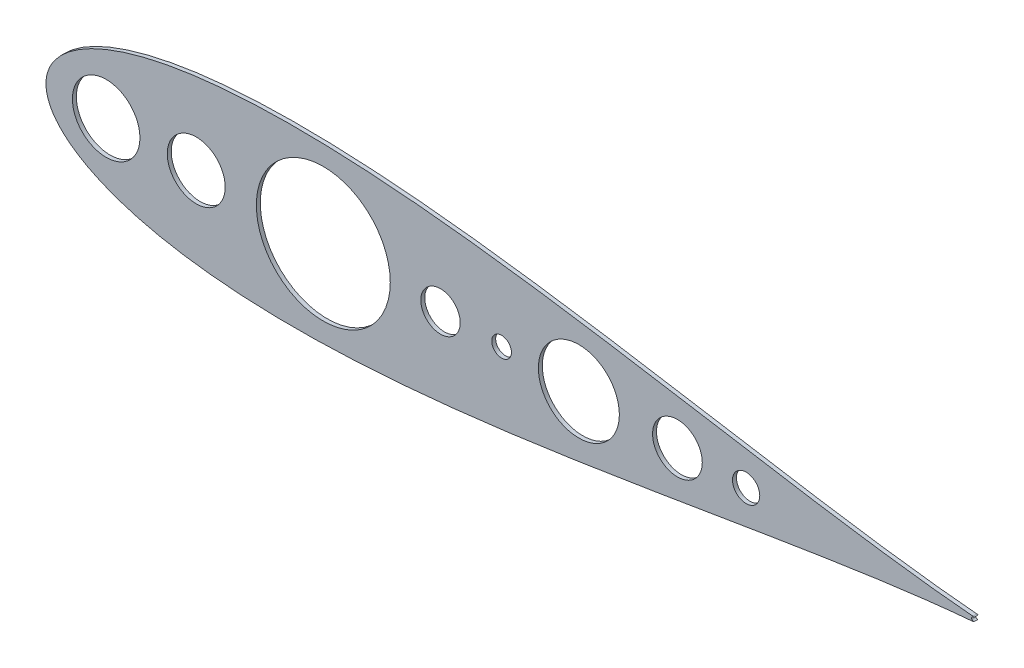
ISO-10303-21;
HEADER;
FILE_DESCRIPTION(('STEP AP214'),'2;1');
FILE_NAME('part.step','',(''),(''),'','','');
FILE_SCHEMA(('AUTOMOTIVE_DESIGN { 1 0 10303 214 1 1 1 1 }'));
ENDSEC;
DATA;
#1=APPLICATION_CONTEXT('core data for automotive mechanical design processes');
#2=APPLICATION_PROTOCOL_DEFINITION('international standard','automotive_design',2000,#1);
#3=PRODUCT_CONTEXT('',#1,'mechanical');
#4=PRODUCT('Part','Part','',(#3));
#5=PRODUCT_RELATED_PRODUCT_CATEGORY('part','',(#4));
#6=PRODUCT_DEFINITION_FORMATION('','',#4);
#7=PRODUCT_DEFINITION_CONTEXT('part definition',#1,'design');
#8=PRODUCT_DEFINITION('design','',#6,#7);
#9=PRODUCT_DEFINITION_SHAPE('','',#8);
#10=(LENGTH_UNIT() NAMED_UNIT(*) SI_UNIT(.MILLI.,.METRE.));
#11=(NAMED_UNIT(*) PLANE_ANGLE_UNIT() SI_UNIT($,.RADIAN.));
#12=(NAMED_UNIT(*) SI_UNIT($,.STERADIAN.) SOLID_ANGLE_UNIT());
#13=UNCERTAINTY_MEASURE_WITH_UNIT(LENGTH_MEASURE(1.E-05),#10,'distance_accuracy_value','');
#14=(GEOMETRIC_REPRESENTATION_CONTEXT(3) GLOBAL_UNCERTAINTY_ASSIGNED_CONTEXT((#13)) GLOBAL_UNIT_ASSIGNED_CONTEXT((#10,
#11,#12)) REPRESENTATION_CONTEXT('',''));
#15=CARTESIAN_POINT('',(0.,0.,0.));
#16=DIRECTION('',(0.,0.,1.));
#17=DIRECTION('',(1.,0.,0.));
#18=AXIS2_PLACEMENT_3D('',#15,#16,#17);
#19=CARTESIAN_POINT('',(293.281074332777,511.948665511265,2.54));
#20=DIRECTION('',(0.,0.,1.));
#21=DIRECTION('',(1.,0.,0.));
#22=AXIS2_PLACEMENT_3D('',#19,#20,#21);
#23=PLANE('',#22);
#24=CARTESIAN_POINT('',(636.78788281488,511.9486655088,2.54));
#25=DIRECTION('',(0.,0.,1.));
#26=DIRECTION('',(1.,0.,0.));
#27=AXIS2_PLACEMENT_3D('',#24,#25,#26);
#28=CIRCLE('',#27,26.103165950104);
#29=CARTESIAN_POINT('',(662.891048764984,511.9486655088,2.54));
#30=VERTEX_POINT('',#29);
#31=EDGE_CURVE('E156',#30,#30,#28,.T.);
#32=ORIENTED_EDGE('',*,*,#31,.F.);
#33=EDGE_LOOP('',(#32));
#34=FACE_BOUND('',#33,.T.);
#35=CARTESIAN_POINT('',(744.61753790952,511.9486655088,2.54));
#36=DIRECTION('',(0.,0.,1.));
#37=DIRECTION('',(1.,0.,0.));
#38=AXIS2_PLACEMENT_3D('',#35,#36,#37);
#39=CIRCLE('',#38,8.77991454979843);
#40=CARTESIAN_POINT('',(753.397452459318,511.9486655088,2.54));
#41=VERTEX_POINT('',#40);
#42=EDGE_CURVE('E144',#41,#41,#39,.T.);
#43=ORIENTED_EDGE('',*,*,#42,.F.);
#44=EDGE_LOOP('',(#43));
#45=FACE_BOUND('',#44,.T.);
#46=CARTESIAN_POINT('',(586.98127433584,511.9486655088,2.54));
#47=DIRECTION('',(0.,0.,1.));
#48=DIRECTION('',(1.,0.,0.));
#49=AXIS2_PLACEMENT_3D('',#46,#47,#48);
#50=CIRCLE('',#49,6.34999999999997);
#51=CARTESIAN_POINT('',(593.33127433584,511.9486655088,2.54));
#52=VERTEX_POINT('',#51);
#53=EDGE_CURVE('E132',#52,#52,#50,.T.);
#54=ORIENTED_EDGE('',*,*,#53,.F.);
#55=EDGE_LOOP('',(#54));
#56=FACE_BOUND('',#55,.T.);
#57=CARTESIAN_POINT('',(390.13127433584,511.9486655088,2.54));
#58=DIRECTION('',(0.,0.,1.));
#59=DIRECTION('',(1.,0.,0.));
#60=AXIS2_PLACEMENT_3D('',#57,#58,#59);
#61=CIRCLE('',#60,18.6689999999999);
#62=CARTESIAN_POINT('',(408.80027433584,511.9486655088,2.54));
#63=VERTEX_POINT('',#62);
#64=EDGE_CURVE('E102',#63,#63,#61,.T.);
#65=ORIENTED_EDGE('',*,*,#64,.F.);
#66=EDGE_LOOP('',(#65));
#67=FACE_BOUND('',#66,.T.);
#68=CARTESIAN_POINT('',(890.816164168458,513.419961883276,2.54));
#69=CARTESIAN_POINT('',(890.334929222463,513.459981197692,2.54));
#70=CARTESIAN_POINT('',(886.708241771343,513.765463670193,2.54));
#71=CARTESIAN_POINT('',(879.565924572377,514.42561401996,2.54));
#72=CARTESIAN_POINT('',(868.964209832362,515.528471418864,2.54));
#73=CARTESIAN_POINT('',(857.20981364929,516.881784465856,2.54));
#74=CARTESIAN_POINT('',(844.346922272858,518.493665974868,2.54));
#75=CARTESIAN_POINT('',(830.435546641441,520.365757128014,2.54));
#76=CARTESIAN_POINT('',(815.535846115861,522.493860762432,2.54));
#77=CARTESIAN_POINT('',(799.712341782355,524.866984309935,2.54));
#78=CARTESIAN_POINT('',(783.032227934358,527.468245811526,2.54));
#79=CARTESIAN_POINT('',(765.565384489564,530.274419357803,2.54));
#80=CARTESIAN_POINT('',(747.383994901044,533.256521030107,2.54));
#81=CARTESIAN_POINT('',(728.562336325927,536.380171047203,2.54));
#82=CARTESIAN_POINT('',(709.176538958084,539.605942422981,2.54));
#83=CARTESIAN_POINT('',(689.304458456661,542.890066943461,2.54));
#84=CARTESIAN_POINT('',(669.025547896684,546.184960618188,2.54));
#85=CARTESIAN_POINT('',(648.420790788461,549.44000368776,2.54));
#86=CARTESIAN_POINT('',(627.572657185303,552.602222866306,2.54));
#87=CARTESIAN_POINT('',(606.565100392317,555.617231646054,2.54));
#88=CARTESIAN_POINT('',(585.483547135738,558.429920333749,2.54));
#89=CARTESIAN_POINT('',(564.414918297487,560.985438325884,2.54));
#90=CARTESIAN_POINT('',(543.447643351795,563.229982452078,2.54));
#91=CARTESIAN_POINT('',(522.671673877274,565.111747072054,2.54));
#92=CARTESIAN_POINT('',(502.178474967173,566.581679787562,2.54));
#93=CARTESIAN_POINT('',(482.061023450222,567.594398692486,2.54));
#94=CARTESIAN_POINT('',(462.413787665696,568.109046223437,2.54));
#95=CARTESIAN_POINT('',(443.332695327485,568.089939542713,2.54));
#96=CARTESIAN_POINT('',(424.915165792791,567.506768627899,2.54));
#97=CARTESIAN_POINT('',(407.260111585575,566.336700547836,2.54));
#98=CARTESIAN_POINT('',(390.468225820068,564.562768168251,2.54));
#99=CARTESIAN_POINT('',(374.642141664401,562.176975246489,2.54));
#100=CARTESIAN_POINT('',(359.887391690143,559.178484874051,2.54));
#101=CARTESIAN_POINT('',(346.313124376748,555.57733056226,2.54));
#102=CARTESIAN_POINT('',(334.034096859703,551.394617799159,2.54));
#103=CARTESIAN_POINT('',(323.172804404937,546.667615257906,2.54));
#104=CARTESIAN_POINT('',(313.861144191824,541.458918976372,2.54));
#105=CARTESIAN_POINT('',(306.238228210016,535.874228769802,2.54));
#106=CARTESIAN_POINT('',(300.432417667638,530.095948608945,2.54));
#107=CARTESIAN_POINT('',(296.501791131852,524.42959512248,2.54));
#108=CARTESIAN_POINT('',(294.309964234414,519.317417685557,2.54));
#109=CARTESIAN_POINT('',(293.42486310364,515.216496363283,2.54));
#110=CARTESIAN_POINT('',(293.223273347003,511.948665511265,2.54));
#111=CARTESIAN_POINT('',(293.42486310364,508.680834659247,2.54));
#112=CARTESIAN_POINT('',(294.309964234414,504.579913336973,2.54));
#113=CARTESIAN_POINT('',(296.501791131852,499.46773590005,2.54));
#114=CARTESIAN_POINT('',(300.432417667638,493.801382413586,2.54));
#115=CARTESIAN_POINT('',(306.238228210016,488.023102252728,2.54));
#116=CARTESIAN_POINT('',(313.861144191824,482.438412046158,2.54));
#117=CARTESIAN_POINT('',(323.172804404937,477.229715764624,2.54));
#118=CARTESIAN_POINT('',(334.034096859703,472.50271322337,2.54));
#119=CARTESIAN_POINT('',(346.313124376748,468.32000046027,2.54));
#120=CARTESIAN_POINT('',(359.887391690143,464.718846148479,2.54));
#121=CARTESIAN_POINT('',(374.642141664401,461.720355776041,2.54));
#122=CARTESIAN_POINT('',(390.468225820069,459.334562854279,2.54));
#123=CARTESIAN_POINT('',(407.260111585575,457.560630474694,2.54));
#124=CARTESIAN_POINT('',(424.915165792791,456.390562394631,2.54));
#125=CARTESIAN_POINT('',(443.332695327485,455.807391479817,2.54));
#126=CARTESIAN_POINT('',(462.413787665696,455.788284799093,2.54));
#127=CARTESIAN_POINT('',(482.061023450222,456.302932330044,2.54));
#128=CARTESIAN_POINT('',(502.178474967174,457.315651234968,2.54));
#129=CARTESIAN_POINT('',(522.671673877274,458.785583950476,2.54));
#130=CARTESIAN_POINT('',(543.447643351795,460.667348570452,2.54));
#131=CARTESIAN_POINT('',(564.414918297487,462.911892696646,2.54));
#132=CARTESIAN_POINT('',(585.483547135738,465.46741068878,2.54));
#133=CARTESIAN_POINT('',(606.565100392317,468.280099376476,2.54));
#134=CARTESIAN_POINT('',(627.572657185303,471.295108156224,2.54));
#135=CARTESIAN_POINT('',(648.420790788461,474.45732733477,2.54));
#136=CARTESIAN_POINT('',(669.025547896684,477.712370404342,2.54));
#137=CARTESIAN_POINT('',(689.304458456661,481.007264079069,2.54));
#138=CARTESIAN_POINT('',(709.176538958084,484.291388599549,2.54));
#139=CARTESIAN_POINT('',(728.562336325927,487.517159975327,2.54));
#140=CARTESIAN_POINT('',(747.383994901044,490.640809992423,2.54));
#141=CARTESIAN_POINT('',(765.565384489564,493.622911664727,2.54));
#142=CARTESIAN_POINT('',(783.032227934358,496.429085211004,2.54));
#143=CARTESIAN_POINT('',(799.712341782354,499.030346712595,2.54));
#144=CARTESIAN_POINT('',(815.535846115861,501.403470260098,2.54));
#145=CARTESIAN_POINT('',(830.435546641441,503.531573894516,2.54));
#146=CARTESIAN_POINT('',(844.346922272858,505.403665047661,2.54));
#147=CARTESIAN_POINT('',(857.20981364929,507.015546556674,2.54));
#148=CARTESIAN_POINT('',(868.964209832361,508.368859603666,2.54));
#149=CARTESIAN_POINT('',(879.565924572377,509.47171700257,2.54));
#150=CARTESIAN_POINT('',(886.708241771343,510.131867352337,2.54));
#151=CARTESIAN_POINT('',(890.334929222463,510.437349824838,2.54));
#152=CARTESIAN_POINT('',(890.816164168458,510.477369134324,2.54));
#153=B_SPLINE_CURVE_WITH_KNOTS('',3,(#68,#69,#70,#71,#72,#73,#74,#75,#76,#77,#78,#79,#80,#81,
#82,#83,#84,#85,#86,#87,#88,#89,#90,#91,#92,#93,#94,#95,#96,#97,#98,#99,#100,#101,#102,#103,
#104,#105,#106,#107,#108,#109,#110,#111,#112,#113,#114,#115,#116,#117,#118,#119,#120,#121,#122,
#123,#124,#125,#126,#127,#128,#129,#130,#131,#132,#133,#134,#135,#136,#137,#138,#139,#140,#141,
#142,#143,#144,#145,#146,#147,#148,#149,#150,#151,#152),.UNSPECIFIED.,.F.,.F.,(4,1,1,1,1,1,1,1,
1,1,1,1,1,1,1,1,1,1,1,1,1,1,1,1,1,1,1,1,1,1,1,1,1,1,1,1,1,1,1,1,1,1,1,1,1,1,1,1,1,1,1,1,1,1,1,1,
1,1,1,1,1,1,1,1,1,1,1,1,1,1,1,1,1,1,1,1,1,1,1,1,1,1,4),(0.020157042076269,0.0212708876900959,
0.0285525550130683,0.0367806836725549,0.0459201019032637,0.0559317636633187,0.0667728836144854,
0.0783971303496518,0.0907548266908363,0.103793164577546,0.117456431914319,0.131686225652521,
0.146421738497113,0.161599998000845,0.177156132626574,0.193023668070302,0.209134785631037,
0.225420632511523,0.241811601924249,0.258237646860869,0.274628556698349,0.290914287398014,
0.307025228908797,0.322892517177238,0.33844834182358,0.353626206573582,0.368361231970712,
0.382590427827798,0.396252960572084,0.40929041186716,0.421647009590257,0.433269881487031,
0.444109248914041,0.454118639688981,0.463255054987312,0.471479113777303,0.478755288570903,
0.485052318112802,0.490344025694165,0.494609832614287,0.497833231437255,0.5,0.502166768562745,
0.505390167385713,0.509655974305835,0.514947681887198,0.521244711429097,0.528520886222697,
0.536744945012688,0.545881360311019,0.555890751085959,0.566730118512969,0.578352990409744,
0.59070958813284,0.603747039427916,0.617409572172202,0.631638768029288,0.646373793426418,
0.66155165817642,0.677107482822761,0.692974771091203,0.709085712601986,0.725371443301651,
0.741762353139131,0.758188398075751,0.774579367488477,0.790865214368963,0.806976331929698,
0.822843867373426,0.838400001999155,0.853578261502887,0.868313774347479,0.882543568085681,
0.896206835422454,0.909245173309164,0.921602869650348,0.933227116385514,0.944068236336681,
0.954079898096736,0.963219316327445,0.971447444986932,0.978729112309904,0.979842957923731),.UNSPECIFIED.);
#154=CARTESIAN_POINT('',(890.816164168567,513.419961884589,2.54));
#155=VERTEX_POINT('',#154);
#156=CARTESIAN_POINT('',(890.816164168458,510.477369134324,2.54));
#157=VERTEX_POINT('',#156);
#158=EDGE_CURVE('E86',#155,#157,#153,.T.);
#159=ORIENTED_EDGE('',*,*,#158,.T.);
#160=CARTESIAN_POINT('',(890.693811728639,511.948665508647,2.54));
#161=DIRECTION('',(0.,0.,1.));
#162=DIRECTION('',(1.,0.,0.));
#163=AXIS2_PLACEMENT_3D('',#160,#161,#162);
#164=CIRCLE('',#163,1.47637499999994);
#165=CARTESIAN_POINT('',(891.548394930267,510.744767385,2.54));
#166=VERTEX_POINT('',#165);
#167=EDGE_CURVE('E81',#157,#166,#164,.T.);
#168=ORIENTED_EDGE('',*,*,#167,.T.);
#169=CARTESIAN_POINT('',(891.23224177376,511.94854325352,2.54));
#170=DIRECTION('',(0.,0.,-1.));
#171=DIRECTION('',(1.,0.,0.));
#172=AXIS2_PLACEMENT_3D('',#169,#170,#171);
#173=CIRCLE('',#172,1.24460000000018);
#174=CARTESIAN_POINT('',(891.548941560062,513.152175424197,2.54));
#175=VERTEX_POINT('',#174);
#176=EDGE_CURVE('E84',#166,#175,#173,.T.);
#177=ORIENTED_EDGE('',*,*,#176,.T.);
#178=CARTESIAN_POINT('',(890.693811728639,511.948665508647,2.54));
#179=DIRECTION('',(0.,0.,1.));
#180=DIRECTION('',(1.,0.,0.));
#181=AXIS2_PLACEMENT_3D('',#178,#179,#180);
#182=CIRCLE('',#181,1.47637500162258);
#183=EDGE_CURVE('E51',#175,#155,#182,.T.);
#184=ORIENTED_EDGE('',*,*,#183,.T.);
#185=EDGE_LOOP('',(#159,#168,#177,#184));
#186=FACE_BOUND('',#185,.T.);
#187=CARTESIAN_POINT('',(547.61127433584,511.9486655088,2.54));
#188=DIRECTION('',(0.,0.,1.));
#189=DIRECTION('',(1.,0.,0.));
#190=AXIS2_PLACEMENT_3D('',#187,#188,#189);
#191=CIRCLE('',#190,12.7);
#192=CARTESIAN_POINT('',(560.31127433584,511.9486655088,2.54));
#193=VERTEX_POINT('',#192);
#194=EDGE_CURVE('E126',#193,#193,#191,.T.);
#195=ORIENTED_EDGE('',*,*,#194,.F.);
#196=EDGE_LOOP('',(#195));
#197=FACE_BOUND('',#196,.T.);
#198=CARTESIAN_POINT('',(700.32344224592,511.9486655088,2.54));
#199=DIRECTION('',(0.,0.,1.));
#200=DIRECTION('',(1.,0.,0.));
#201=AXIS2_PLACEMENT_3D('',#198,#199,#200);
#202=CIRCLE('',#201,16.0287708249209);
#203=CARTESIAN_POINT('',(716.352213070841,511.9486655088,2.54));
#204=VERTEX_POINT('',#203);
#205=EDGE_CURVE('E138',#204,#204,#202,.T.);
#206=ORIENTED_EDGE('',*,*,#205,.F.);
#207=EDGE_LOOP('',(#206));
#208=FACE_BOUND('',#207,.T.);
#209=CARTESIAN_POINT('',(332.07307721904,511.9486655088,2.54));
#210=DIRECTION('',(0.,0.,1.));
#211=DIRECTION('',(1.,0.,0.));
#212=AXIS2_PLACEMENT_3D('',#209,#210,#211);
#213=CIRCLE('',#212,21.763413500204);
#214=CARTESIAN_POINT('',(353.836490719244,511.9486655088,2.54));
#215=VERTEX_POINT('',#214);
#216=EDGE_CURVE('E150',#215,#215,#213,.T.);
#217=ORIENTED_EDGE('',*,*,#216,.F.);
#218=EDGE_LOOP('',(#217));
#219=FACE_BOUND('',#218,.T.);
#220=CARTESIAN_POINT('',(472.05063606448,511.9486655088,2.54));
#221=DIRECTION('',(0.,0.,1.));
#222=DIRECTION('',(1.,0.,0.));
#223=AXIS2_PLACEMENT_3D('',#220,#221,#222);
#224=CIRCLE('',#223,43.1669528798075);
#225=CARTESIAN_POINT('',(515.217588944288,511.9486655088,2.54));
#226=VERTEX_POINT('',#225);
#227=EDGE_CURVE('E162',#226,#226,#224,.T.);
#228=ORIENTED_EDGE('',*,*,#227,.F.);
#229=EDGE_LOOP('',(#228));
#230=FACE_BOUND('',#229,.T.);
#231=ADVANCED_FACE('F33',(#34,#45,#56,#67,#186,#197,#208,#219,#230),#23,.T.);
#232=CARTESIAN_POINT('',(293.281074332777,511.948665511265,0.));
#233=DIRECTION('',(0.,0.,1.));
#234=DIRECTION('',(1.,0.,0.));
#235=AXIS2_PLACEMENT_3D('',#232,#233,#234);
#236=PLANE('',#235);
#237=CARTESIAN_POINT('',(890.816164168458,513.419961883276,0.));
#238=CARTESIAN_POINT('',(890.334929222463,513.459981197692,0.));
#239=CARTESIAN_POINT('',(886.708241771343,513.765463670193,0.));
#240=CARTESIAN_POINT('',(879.565924572377,514.42561401996,0.));
#241=CARTESIAN_POINT('',(868.964209832362,515.528471418864,0.));
#242=CARTESIAN_POINT('',(857.20981364929,516.881784465856,0.));
#243=CARTESIAN_POINT('',(844.346922272858,518.493665974868,0.));
#244=CARTESIAN_POINT('',(830.435546641441,520.365757128014,0.));
#245=CARTESIAN_POINT('',(815.535846115861,522.493860762432,0.));
#246=CARTESIAN_POINT('',(799.712341782355,524.866984309935,0.));
#247=CARTESIAN_POINT('',(783.032227934358,527.468245811526,0.));
#248=CARTESIAN_POINT('',(765.565384489564,530.274419357803,0.));
#249=CARTESIAN_POINT('',(747.383994901044,533.256521030107,0.));
#250=CARTESIAN_POINT('',(728.562336325927,536.380171047203,0.));
#251=CARTESIAN_POINT('',(709.176538958084,539.605942422981,0.));
#252=CARTESIAN_POINT('',(689.304458456661,542.890066943461,0.));
#253=CARTESIAN_POINT('',(669.025547896684,546.184960618188,0.));
#254=CARTESIAN_POINT('',(648.420790788461,549.44000368776,0.));
#255=CARTESIAN_POINT('',(627.572657185303,552.602222866306,0.));
#256=CARTESIAN_POINT('',(606.565100392317,555.617231646054,0.));
#257=CARTESIAN_POINT('',(585.483547135738,558.429920333749,0.));
#258=CARTESIAN_POINT('',(564.414918297487,560.985438325884,0.));
#259=CARTESIAN_POINT('',(543.447643351795,563.229982452078,0.));
#260=CARTESIAN_POINT('',(522.671673877274,565.111747072054,0.));
#261=CARTESIAN_POINT('',(502.178474967173,566.581679787562,0.));
#262=CARTESIAN_POINT('',(482.061023450222,567.594398692486,0.));
#263=CARTESIAN_POINT('',(462.413787665696,568.109046223437,0.));
#264=CARTESIAN_POINT('',(443.332695327485,568.089939542713,0.));
#265=CARTESIAN_POINT('',(424.915165792791,567.506768627899,0.));
#266=CARTESIAN_POINT('',(407.260111585575,566.336700547836,0.));
#267=CARTESIAN_POINT('',(390.468225820068,564.562768168251,0.));
#268=CARTESIAN_POINT('',(374.642141664401,562.176975246489,0.));
#269=CARTESIAN_POINT('',(359.887391690143,559.178484874051,0.));
#270=CARTESIAN_POINT('',(346.313124376748,555.57733056226,0.));
#271=CARTESIAN_POINT('',(334.034096859703,551.394617799159,0.));
#272=CARTESIAN_POINT('',(323.172804404937,546.667615257906,0.));
#273=CARTESIAN_POINT('',(313.861144191824,541.458918976372,0.));
#274=CARTESIAN_POINT('',(306.238228210016,535.874228769802,0.));
#275=CARTESIAN_POINT('',(300.432417667638,530.095948608945,0.));
#276=CARTESIAN_POINT('',(296.501791131852,524.42959512248,0.));
#277=CARTESIAN_POINT('',(294.309964234414,519.317417685557,0.));
#278=CARTESIAN_POINT('',(293.42486310364,515.216496363283,0.));
#279=CARTESIAN_POINT('',(293.223273347003,511.948665511265,0.));
#280=CARTESIAN_POINT('',(293.42486310364,508.680834659247,0.));
#281=CARTESIAN_POINT('',(294.309964234414,504.579913336973,0.));
#282=CARTESIAN_POINT('',(296.501791131852,499.46773590005,0.));
#283=CARTESIAN_POINT('',(300.432417667638,493.801382413586,0.));
#284=CARTESIAN_POINT('',(306.238228210016,488.023102252728,0.));
#285=CARTESIAN_POINT('',(313.861144191824,482.438412046158,0.));
#286=CARTESIAN_POINT('',(323.172804404937,477.229715764624,0.));
#287=CARTESIAN_POINT('',(334.034096859703,472.50271322337,0.));
#288=CARTESIAN_POINT('',(346.313124376748,468.32000046027,0.));
#289=CARTESIAN_POINT('',(359.887391690143,464.718846148479,0.));
#290=CARTESIAN_POINT('',(374.642141664401,461.720355776041,0.));
#291=CARTESIAN_POINT('',(390.468225820069,459.334562854279,0.));
#292=CARTESIAN_POINT('',(407.260111585575,457.560630474694,0.));
#293=CARTESIAN_POINT('',(424.915165792791,456.390562394631,0.));
#294=CARTESIAN_POINT('',(443.332695327485,455.807391479817,0.));
#295=CARTESIAN_POINT('',(462.413787665696,455.788284799093,0.));
#296=CARTESIAN_POINT('',(482.061023450222,456.302932330044,0.));
#297=CARTESIAN_POINT('',(502.178474967174,457.315651234968,0.));
#298=CARTESIAN_POINT('',(522.671673877274,458.785583950476,0.));
#299=CARTESIAN_POINT('',(543.447643351795,460.667348570452,0.));
#300=CARTESIAN_POINT('',(564.414918297487,462.911892696646,0.));
#301=CARTESIAN_POINT('',(585.483547135738,465.46741068878,0.));
#302=CARTESIAN_POINT('',(606.565100392317,468.280099376476,0.));
#303=CARTESIAN_POINT('',(627.572657185303,471.295108156224,0.));
#304=CARTESIAN_POINT('',(648.420790788461,474.45732733477,0.));
#305=CARTESIAN_POINT('',(669.025547896684,477.712370404342,0.));
#306=CARTESIAN_POINT('',(689.304458456661,481.007264079069,0.));
#307=CARTESIAN_POINT('',(709.176538958084,484.291388599549,0.));
#308=CARTESIAN_POINT('',(728.562336325927,487.517159975327,0.));
#309=CARTESIAN_POINT('',(747.383994901044,490.640809992423,0.));
#310=CARTESIAN_POINT('',(765.565384489564,493.622911664727,0.));
#311=CARTESIAN_POINT('',(783.032227934358,496.429085211004,0.));
#312=CARTESIAN_POINT('',(799.712341782354,499.030346712595,0.));
#313=CARTESIAN_POINT('',(815.535846115861,501.403470260098,0.));
#314=CARTESIAN_POINT('',(830.435546641441,503.531573894516,0.));
#315=CARTESIAN_POINT('',(844.346922272858,505.403665047661,0.));
#316=CARTESIAN_POINT('',(857.20981364929,507.015546556674,0.));
#317=CARTESIAN_POINT('',(868.964209832361,508.368859603666,0.));
#318=CARTESIAN_POINT('',(879.565924572377,509.47171700257,0.));
#319=CARTESIAN_POINT('',(886.708241771343,510.131867352337,0.));
#320=CARTESIAN_POINT('',(890.334929222463,510.437349824838,0.));
#321=CARTESIAN_POINT('',(890.816164168458,510.477369134324,0.));
#322=B_SPLINE_CURVE_WITH_KNOTS('',3,(#237,#238,#239,#240,#241,#242,#243,#244,#245,#246,#247,
#248,#249,#250,#251,#252,#253,#254,#255,#256,#257,#258,#259,#260,#261,#262,#263,#264,#265,#266,
#267,#268,#269,#270,#271,#272,#273,#274,#275,#276,#277,#278,#279,#280,#281,#282,#283,#284,#285,
#286,#287,#288,#289,#290,#291,#292,#293,#294,#295,#296,#297,#298,#299,#300,#301,#302,#303,#304,
#305,#306,#307,#308,#309,#310,#311,#312,#313,#314,#315,#316,#317,#318,#319,#320,#321),
.UNSPECIFIED.,.F.,.F.,(4,1,1,1,1,1,1,1,1,1,1,1,1,1,1,1,1,1,1,1,1,1,1,1,1,1,1,1,1,1,1,1,1,1,1,1,
1,1,1,1,1,1,1,1,1,1,1,1,1,1,1,1,1,1,1,1,1,1,1,1,1,1,1,1,1,1,1,1,1,1,1,1,1,1,1,1,1,1,1,1,1,1,4),
(0.020157042076269,0.0212708876900959,0.0285525550130683,0.0367806836725549,0.0459201019032637,
0.0559317636633187,0.0667728836144854,0.0783971303496518,0.0907548266908363,0.103793164577546,
0.117456431914319,0.131686225652521,0.146421738497113,0.161599998000845,0.177156132626574,
0.193023668070302,0.209134785631037,0.225420632511523,0.241811601924249,0.258237646860869,
0.274628556698349,0.290914287398014,0.307025228908797,0.322892517177238,0.33844834182358,
0.353626206573582,0.368361231970712,0.382590427827798,0.396252960572084,0.40929041186716,
0.421647009590257,0.433269881487031,0.444109248914041,0.454118639688981,0.463255054987312,
0.471479113777303,0.478755288570903,0.485052318112802,0.490344025694165,0.494609832614287,
0.497833231437255,0.5,0.502166768562745,0.505390167385713,0.509655974305835,0.514947681887198,
0.521244711429097,0.528520886222697,0.536744945012688,0.545881360311019,0.555890751085959,
0.566730118512969,0.578352990409744,0.59070958813284,0.603747039427916,0.617409572172202,
0.631638768029288,0.646373793426418,0.66155165817642,0.677107482822761,0.692974771091203,
0.709085712601986,0.725371443301651,0.741762353139131,0.758188398075751,0.774579367488477,
0.790865214368963,0.806976331929698,0.822843867373426,0.838400001999155,0.853578261502887,
0.868313774347479,0.882543568085681,0.896206835422454,0.909245173309164,0.921602869650348,
0.933227116385514,0.944068236336681,0.954079898096736,0.963219316327445,0.971447444986932,
0.978729112309904,0.979842957923731),.UNSPECIFIED.);
#323=CARTESIAN_POINT('',(890.816164168567,513.419961884589,0.));
#324=VERTEX_POINT('',#323);
#325=CARTESIAN_POINT('',(890.816164168458,510.477369134324,0.));
#326=VERTEX_POINT('',#325);
#327=EDGE_CURVE('E97',#324,#326,#322,.T.);
#328=ORIENTED_EDGE('',*,*,#327,.F.);
#329=CARTESIAN_POINT('',(890.693811728639,511.948665508647,0.));
#330=DIRECTION('',(0.,0.,1.));
#331=DIRECTION('',(1.,0.,0.));
#332=AXIS2_PLACEMENT_3D('',#329,#330,#331);
#333=CIRCLE('',#332,1.47637500162258);
#334=CARTESIAN_POINT('',(891.548941560062,513.152175424197,0.));
#335=VERTEX_POINT('',#334);
#336=EDGE_CURVE('E74',#335,#324,#333,.T.);
#337=ORIENTED_EDGE('',*,*,#336,.F.);
#338=CARTESIAN_POINT('',(891.23224177376,511.94854325352,0.));
#339=DIRECTION('',(0.,0.,-1.));
#340=DIRECTION('',(1.,0.,0.));
#341=AXIS2_PLACEMENT_3D('',#338,#339,#340);
#342=CIRCLE('',#341,1.24460000000018);
#343=CARTESIAN_POINT('',(891.548394930267,510.744767385,0.));
#344=VERTEX_POINT('',#343);
#345=EDGE_CURVE('E68',#344,#335,#342,.T.);
#346=ORIENTED_EDGE('',*,*,#345,.F.);
#347=CARTESIAN_POINT('',(890.693811728639,511.948665508647,0.));
#348=DIRECTION('',(0.,0.,1.));
#349=DIRECTION('',(1.,0.,0.));
#350=AXIS2_PLACEMENT_3D('',#347,#348,#349);
#351=CIRCLE('',#350,1.47637499999994);
#352=EDGE_CURVE('E90',#326,#344,#351,.T.);
#353=ORIENTED_EDGE('',*,*,#352,.F.);
#354=EDGE_LOOP('',(#328,#337,#346,#353));
#355=FACE_BOUND('',#354,.T.);
#356=CARTESIAN_POINT('',(390.13127433584,511.9486655088,0.));
#357=DIRECTION('',(0.,0.,1.));
#358=DIRECTION('',(1.,0.,0.));
#359=AXIS2_PLACEMENT_3D('',#356,#357,#358);
#360=CIRCLE('',#359,18.6689999999999);
#361=CARTESIAN_POINT('',(408.80027433584,511.9486655088,0.));
#362=VERTEX_POINT('',#361);
#363=EDGE_CURVE('E120',#362,#362,#360,.T.);
#364=ORIENTED_EDGE('',*,*,#363,.T.);
#365=EDGE_LOOP('',(#364));
#366=FACE_BOUND('',#365,.T.);
#367=CARTESIAN_POINT('',(547.61127433584,511.9486655088,0.));
#368=DIRECTION('',(0.,0.,1.));
#369=DIRECTION('',(1.,0.,0.));
#370=AXIS2_PLACEMENT_3D('',#367,#368,#369);
#371=CIRCLE('',#370,12.7);
#372=CARTESIAN_POINT('',(560.31127433584,511.9486655088,0.));
#373=VERTEX_POINT('',#372);
#374=EDGE_CURVE('E129',#373,#373,#371,.T.);
#375=ORIENTED_EDGE('',*,*,#374,.T.);
#376=EDGE_LOOP('',(#375));
#377=FACE_BOUND('',#376,.T.);
#378=CARTESIAN_POINT('',(586.98127433584,511.9486655088,0.));
#379=DIRECTION('',(0.,0.,1.));
#380=DIRECTION('',(1.,0.,0.));
#381=AXIS2_PLACEMENT_3D('',#378,#379,#380);
#382=CIRCLE('',#381,6.34999999999997);
#383=CARTESIAN_POINT('',(593.33127433584,511.9486655088,0.));
#384=VERTEX_POINT('',#383);
#385=EDGE_CURVE('E135',#384,#384,#382,.T.);
#386=ORIENTED_EDGE('',*,*,#385,.T.);
#387=EDGE_LOOP('',(#386));
#388=FACE_BOUND('',#387,.T.);
#389=CARTESIAN_POINT('',(700.32344224592,511.9486655088,0.));
#390=DIRECTION('',(0.,0.,1.));
#391=DIRECTION('',(1.,0.,0.));
#392=AXIS2_PLACEMENT_3D('',#389,#390,#391);
#393=CIRCLE('',#392,16.0287708249209);
#394=CARTESIAN_POINT('',(716.352213070841,511.9486655088,0.));
#395=VERTEX_POINT('',#394);
#396=EDGE_CURVE('E141',#395,#395,#393,.T.);
#397=ORIENTED_EDGE('',*,*,#396,.T.);
#398=EDGE_LOOP('',(#397));
#399=FACE_BOUND('',#398,.T.);
#400=CARTESIAN_POINT('',(744.61753790952,511.9486655088,0.));
#401=DIRECTION('',(0.,0.,1.));
#402=DIRECTION('',(1.,0.,0.));
#403=AXIS2_PLACEMENT_3D('',#400,#401,#402);
#404=CIRCLE('',#403,8.77991454979843);
#405=CARTESIAN_POINT('',(753.397452459318,511.9486655088,0.));
#406=VERTEX_POINT('',#405);
#407=EDGE_CURVE('E147',#406,#406,#404,.T.);
#408=ORIENTED_EDGE('',*,*,#407,.T.);
#409=EDGE_LOOP('',(#408));
#410=FACE_BOUND('',#409,.T.);
#411=CARTESIAN_POINT('',(332.07307721904,511.9486655088,0.));
#412=DIRECTION('',(0.,0.,1.));
#413=DIRECTION('',(1.,0.,0.));
#414=AXIS2_PLACEMENT_3D('',#411,#412,#413);
#415=CIRCLE('',#414,21.763413500204);
#416=CARTESIAN_POINT('',(353.836490719244,511.9486655088,0.));
#417=VERTEX_POINT('',#416);
#418=EDGE_CURVE('E153',#417,#417,#415,.T.);
#419=ORIENTED_EDGE('',*,*,#418,.T.);
#420=EDGE_LOOP('',(#419));
#421=FACE_BOUND('',#420,.T.);
#422=CARTESIAN_POINT('',(636.78788281488,511.9486655088,0.));
#423=DIRECTION('',(0.,0.,1.));
#424=DIRECTION('',(1.,0.,0.));
#425=AXIS2_PLACEMENT_3D('',#422,#423,#424);
#426=CIRCLE('',#425,26.103165950104);
#427=CARTESIAN_POINT('',(662.891048764984,511.9486655088,0.));
#428=VERTEX_POINT('',#427);
#429=EDGE_CURVE('E159',#428,#428,#426,.T.);
#430=ORIENTED_EDGE('',*,*,#429,.T.);
#431=EDGE_LOOP('',(#430));
#432=FACE_BOUND('',#431,.T.);
#433=CARTESIAN_POINT('',(472.05063606448,511.9486655088,0.));
#434=DIRECTION('',(0.,0.,1.));
#435=DIRECTION('',(1.,0.,0.));
#436=AXIS2_PLACEMENT_3D('',#433,#434,#435);
#437=CIRCLE('',#436,43.1669528798075);
#438=CARTESIAN_POINT('',(515.217588944288,511.9486655088,0.));
#439=VERTEX_POINT('',#438);
#440=EDGE_CURVE('E165',#439,#439,#437,.T.);
#441=ORIENTED_EDGE('',*,*,#440,.T.);
#442=EDGE_LOOP('',(#441));
#443=FACE_BOUND('',#442,.T.);
#444=ADVANCED_FACE('F113',(#355,#366,#377,#388,#399,#410,#421,#432,#443),#236,.F.);
#445=DIRECTION('',(0.,0.,-1.));
#446=VECTOR('',#445,1.);
#447=SURFACE_OF_LINEAR_EXTRUSION('',#153,#446);
#448=ORIENTED_EDGE('',*,*,#327,.T.);
#449=DIRECTION('',(0.,0.,-1.));
#450=VECTOR('',#449,1.);
#451=CARTESIAN_POINT('',(890.816164168458,510.477369134324,2.54));
#452=LINE('',#451,#450);
#453=EDGE_CURVE('E11',#157,#326,#452,.T.);
#454=ORIENTED_EDGE('',*,*,#453,.F.);
#455=ORIENTED_EDGE('',*,*,#158,.F.);
#456=DIRECTION('',(0.,0.,-1.));
#457=VECTOR('',#456,1.);
#458=CARTESIAN_POINT('',(890.816164168567,513.419961884589,2.54));
#459=LINE('',#458,#457);
#460=EDGE_CURVE('E94',#155,#324,#459,.T.);
#461=ORIENTED_EDGE('',*,*,#460,.T.);
#462=EDGE_LOOP('',(#448,#454,#455,#461));
#463=FACE_BOUND('',#462,.T.);
#464=ADVANCED_FACE('F35',(#463),#447,.F.);
#465=CARTESIAN_POINT('',(890.693811728639,511.948665508647,2.54));
#466=DIRECTION('',(0.,0.,-1.));
#467=DIRECTION('',(-1.,0.,0.));
#468=AXIS2_PLACEMENT_3D('',#465,#466,#467);
#469=CYLINDRICAL_SURFACE('',#468,1.47637499999994);
#470=ORIENTED_EDGE('',*,*,#352,.T.);
#471=DIRECTION('',(0.,0.,-1.));
#472=VECTOR('',#471,1.);
#473=CARTESIAN_POINT('',(891.548394930267,510.744767385,2.54));
#474=LINE('',#473,#472);
#475=EDGE_CURVE('E43',#166,#344,#474,.T.);
#476=ORIENTED_EDGE('',*,*,#475,.F.);
#477=ORIENTED_EDGE('',*,*,#167,.F.);
#478=ORIENTED_EDGE('',*,*,#453,.T.);
#479=EDGE_LOOP('',(#470,#476,#477,#478));
#480=FACE_BOUND('',#479,.T.);
#481=ADVANCED_FACE('F89',(#480),#469,.T.);
#482=CARTESIAN_POINT('',(891.23224177376,511.94854325352,2.54));
#483=DIRECTION('',(0.,0.,-1.));
#484=DIRECTION('',(-1.,0.,0.));
#485=AXIS2_PLACEMENT_3D('',#482,#483,#484);
#486=CYLINDRICAL_SURFACE('',#485,1.24460000000018);
#487=ORIENTED_EDGE('',*,*,#345,.T.);
#488=DIRECTION('',(0.,0.,-1.));
#489=VECTOR('',#488,1.);
#490=CARTESIAN_POINT('',(891.548941560062,513.152175424197,2.54));
#491=LINE('',#490,#489);
#492=EDGE_CURVE('E91',#175,#335,#491,.T.);
#493=ORIENTED_EDGE('',*,*,#492,.F.);
#494=ORIENTED_EDGE('',*,*,#176,.F.);
#495=ORIENTED_EDGE('',*,*,#475,.T.);
#496=EDGE_LOOP('',(#487,#493,#494,#495));
#497=FACE_BOUND('',#496,.T.);
#498=ADVANCED_FACE('F92',(#497),#486,.F.);
#499=CARTESIAN_POINT('',(890.693811728639,511.948665508647,2.54));
#500=DIRECTION('',(0.,0.,-1.));
#501=DIRECTION('',(-1.,0.,0.));
#502=AXIS2_PLACEMENT_3D('',#499,#500,#501);
#503=CYLINDRICAL_SURFACE('',#502,1.47637500162258);
#504=ORIENTED_EDGE('',*,*,#336,.T.);
#505=ORIENTED_EDGE('',*,*,#460,.F.);
#506=ORIENTED_EDGE('',*,*,#183,.F.);
#507=ORIENTED_EDGE('',*,*,#492,.T.);
#508=EDGE_LOOP('',(#504,#505,#506,#507));
#509=FACE_BOUND('',#508,.T.);
#510=ADVANCED_FACE('F110',(#509),#503,.T.);
#511=CARTESIAN_POINT('',(390.13127433584,511.9486655088,2.54));
#512=DIRECTION('',(0.,0.,-1.));
#513=DIRECTION('',(-1.,0.,0.));
#514=AXIS2_PLACEMENT_3D('',#511,#512,#513);
#515=CYLINDRICAL_SURFACE('',#514,18.6689999999999);
#516=ORIENTED_EDGE('',*,*,#64,.T.);
#517=EDGE_LOOP('',(#516));
#518=FACE_BOUND('',#517,.T.);
#519=ORIENTED_EDGE('',*,*,#363,.F.);
#520=EDGE_LOOP('',(#519));
#521=FACE_BOUND('',#520,.T.);
#522=ADVANCED_FACE('F184',(#518,#521),#515,.F.);
#523=CARTESIAN_POINT('',(547.61127433584,511.9486655088,2.54));
#524=DIRECTION('',(0.,0.,-1.));
#525=DIRECTION('',(-1.,0.,0.));
#526=AXIS2_PLACEMENT_3D('',#523,#524,#525);
#527=CYLINDRICAL_SURFACE('',#526,12.7);
#528=ORIENTED_EDGE('',*,*,#194,.T.);
#529=EDGE_LOOP('',(#528));
#530=FACE_BOUND('',#529,.T.);
#531=ORIENTED_EDGE('',*,*,#374,.F.);
#532=EDGE_LOOP('',(#531));
#533=FACE_BOUND('',#532,.T.);
#534=ADVANCED_FACE('F230',(#530,#533),#527,.F.);
#535=CARTESIAN_POINT('',(586.98127433584,511.9486655088,2.54));
#536=DIRECTION('',(0.,0.,-1.));
#537=DIRECTION('',(-1.,0.,0.));
#538=AXIS2_PLACEMENT_3D('',#535,#536,#537);
#539=CYLINDRICAL_SURFACE('',#538,6.34999999999997);
#540=ORIENTED_EDGE('',*,*,#53,.T.);
#541=EDGE_LOOP('',(#540));
#542=FACE_BOUND('',#541,.T.);
#543=ORIENTED_EDGE('',*,*,#385,.F.);
#544=EDGE_LOOP('',(#543));
#545=FACE_BOUND('',#544,.T.);
#546=ADVANCED_FACE('F238',(#542,#545),#539,.F.);
#547=CARTESIAN_POINT('',(700.32344224592,511.9486655088,2.54));
#548=DIRECTION('',(0.,0.,-1.));
#549=DIRECTION('',(-1.,0.,0.));
#550=AXIS2_PLACEMENT_3D('',#547,#548,#549);
#551=CYLINDRICAL_SURFACE('',#550,16.0287708249209);
#552=ORIENTED_EDGE('',*,*,#205,.T.);
#553=EDGE_LOOP('',(#552));
#554=FACE_BOUND('',#553,.T.);
#555=ORIENTED_EDGE('',*,*,#396,.F.);
#556=EDGE_LOOP('',(#555));
#557=FACE_BOUND('',#556,.T.);
#558=ADVANCED_FACE('F246',(#554,#557),#551,.F.);
#559=CARTESIAN_POINT('',(744.61753790952,511.9486655088,2.54));
#560=DIRECTION('',(0.,0.,-1.));
#561=DIRECTION('',(-1.,0.,0.));
#562=AXIS2_PLACEMENT_3D('',#559,#560,#561);
#563=CYLINDRICAL_SURFACE('',#562,8.77991454979843);
#564=ORIENTED_EDGE('',*,*,#42,.T.);
#565=EDGE_LOOP('',(#564));
#566=FACE_BOUND('',#565,.T.);
#567=ORIENTED_EDGE('',*,*,#407,.F.);
#568=EDGE_LOOP('',(#567));
#569=FACE_BOUND('',#568,.T.);
#570=ADVANCED_FACE('F255',(#566,#569),#563,.F.);
#571=CARTESIAN_POINT('',(332.07307721904,511.9486655088,2.54));
#572=DIRECTION('',(0.,0.,-1.));
#573=DIRECTION('',(-1.,0.,0.));
#574=AXIS2_PLACEMENT_3D('',#571,#572,#573);
#575=CYLINDRICAL_SURFACE('',#574,21.763413500204);
#576=ORIENTED_EDGE('',*,*,#216,.T.);
#577=EDGE_LOOP('',(#576));
#578=FACE_BOUND('',#577,.T.);
#579=ORIENTED_EDGE('',*,*,#418,.F.);
#580=EDGE_LOOP('',(#579));
#581=FACE_BOUND('',#580,.T.);
#582=ADVANCED_FACE('F264',(#578,#581),#575,.F.);
#583=CARTESIAN_POINT('',(636.78788281488,511.9486655088,2.54));
#584=DIRECTION('',(0.,0.,-1.));
#585=DIRECTION('',(-1.,0.,0.));
#586=AXIS2_PLACEMENT_3D('',#583,#584,#585);
#587=CYLINDRICAL_SURFACE('',#586,26.103165950104);
#588=ORIENTED_EDGE('',*,*,#31,.T.);
#589=EDGE_LOOP('',(#588));
#590=FACE_BOUND('',#589,.T.);
#591=ORIENTED_EDGE('',*,*,#429,.F.);
#592=EDGE_LOOP('',(#591));
#593=FACE_BOUND('',#592,.T.);
#594=ADVANCED_FACE('F273',(#590,#593),#587,.F.);
#595=CARTESIAN_POINT('',(472.05063606448,511.9486655088,2.54));
#596=DIRECTION('',(0.,0.,-1.));
#597=DIRECTION('',(-1.,0.,0.));
#598=AXIS2_PLACEMENT_3D('',#595,#596,#597);
#599=CYLINDRICAL_SURFACE('',#598,43.1669528798075);
#600=ORIENTED_EDGE('',*,*,#227,.T.);
#601=EDGE_LOOP('',(#600));
#602=FACE_BOUND('',#601,.T.);
#603=ORIENTED_EDGE('',*,*,#440,.F.);
#604=EDGE_LOOP('',(#603));
#605=FACE_BOUND('',#604,.T.);
#606=ADVANCED_FACE('F171',(#602,#605),#599,.F.);
#607=CLOSED_SHELL('',(#231,#444,#464,#481,#498,#510,#522,#534,#546,#558,#570,#582,#594,#606));
#608=MANIFOLD_SOLID_BREP('B2',#607);
#609=ADVANCED_BREP_SHAPE_REPRESENTATION('',(#18,#608),#14);
#610=SHAPE_DEFINITION_REPRESENTATION(#9,#609);
ENDSEC;
END-ISO-10303-21;
